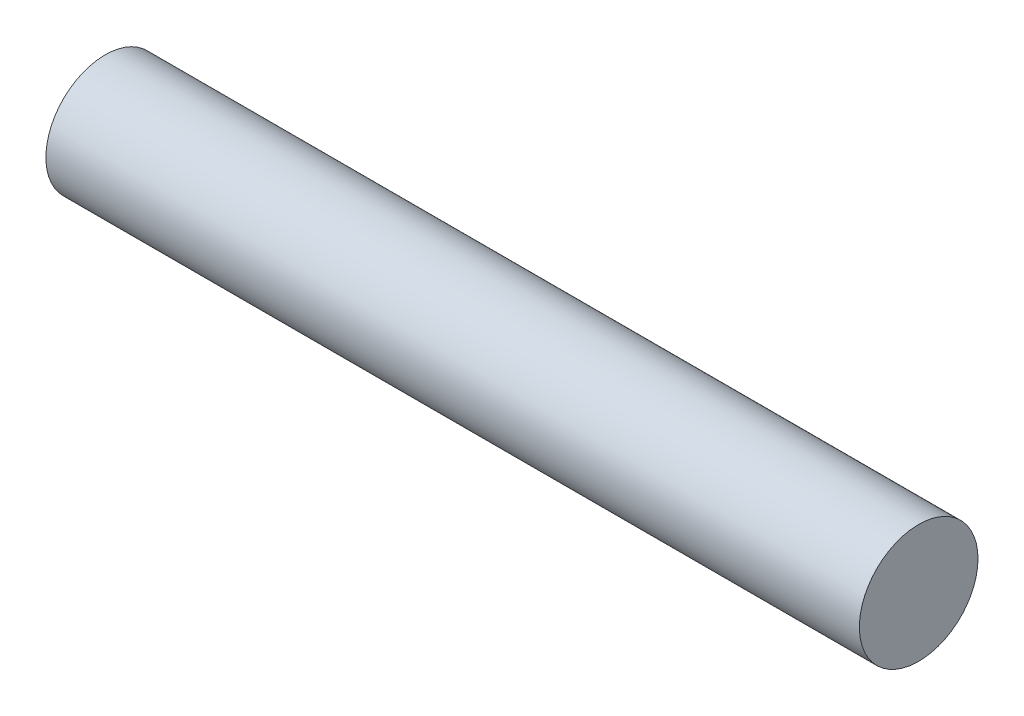
ISO-10303-21;
HEADER;
FILE_DESCRIPTION(('STEP AP214'),'2;1');
FILE_NAME('part.step','',(''),(''),'','','');
FILE_SCHEMA(('AUTOMOTIVE_DESIGN { 1 0 10303 214 1 1 1 1 }'));
ENDSEC;
DATA;
#1=APPLICATION_CONTEXT('core data for automotive mechanical design processes');
#2=APPLICATION_PROTOCOL_DEFINITION('international standard','automotive_design',2000,#1);
#3=PRODUCT_CONTEXT('',#1,'mechanical');
#4=PRODUCT('Part','Part','',(#3));
#5=PRODUCT_RELATED_PRODUCT_CATEGORY('part','',(#4));
#6=PRODUCT_DEFINITION_FORMATION('','',#4);
#7=PRODUCT_DEFINITION_CONTEXT('part definition',#1,'design');
#8=PRODUCT_DEFINITION('design','',#6,#7);
#9=PRODUCT_DEFINITION_SHAPE('','',#8);
#10=(LENGTH_UNIT() NAMED_UNIT(*) SI_UNIT(.MILLI.,.METRE.));
#11=(NAMED_UNIT(*) PLANE_ANGLE_UNIT() SI_UNIT($,.RADIAN.));
#12=(NAMED_UNIT(*) SI_UNIT($,.STERADIAN.) SOLID_ANGLE_UNIT());
#13=UNCERTAINTY_MEASURE_WITH_UNIT(LENGTH_MEASURE(1.E-05),#10,'distance_accuracy_value','');
#14=(GEOMETRIC_REPRESENTATION_CONTEXT(3) GLOBAL_UNCERTAINTY_ASSIGNED_CONTEXT((#13)) GLOBAL_UNIT_ASSIGNED_CONTEXT((#10,
#11,#12)) REPRESENTATION_CONTEXT('',''));
#15=CARTESIAN_POINT('',(0.,0.,0.));
#16=DIRECTION('',(0.,0.,1.));
#17=DIRECTION('',(1.,0.,0.));
#18=AXIS2_PLACEMENT_3D('',#15,#16,#17);
#19=CARTESIAN_POINT('',(76.2,0.,0.));
#20=DIRECTION('',(-1.,0.,0.));
#21=DIRECTION('',(0.,0.,1.));
#22=AXIS2_PLACEMENT_3D('',#19,#20,#21);
#23=CYLINDRICAL_SURFACE('',#22,11.1125);
#24=CARTESIAN_POINT('',(76.2,0.,0.));
#25=DIRECTION('',(1.,0.,0.));
#26=DIRECTION('',(0.,0.,-1.));
#27=AXIS2_PLACEMENT_3D('',#24,#25,#26);
#28=CIRCLE('',#27,11.1125);
#29=CARTESIAN_POINT('',(76.2,0.,-11.1125));
#30=VERTEX_POINT('',#29);
#31=EDGE_CURVE('E10',#30,#30,#28,.T.);
#32=ORIENTED_EDGE('',*,*,#31,.F.);
#33=EDGE_LOOP('',(#32));
#34=FACE_BOUND('',#33,.T.);
#35=CARTESIAN_POINT('',(-76.2,0.,0.));
#36=DIRECTION('',(1.,0.,0.));
#37=DIRECTION('',(0.,0.,-1.));
#38=AXIS2_PLACEMENT_3D('',#35,#36,#37);
#39=CIRCLE('',#38,11.1125);
#40=CARTESIAN_POINT('',(-76.2,0.,-11.1125));
#41=VERTEX_POINT('',#40);
#42=EDGE_CURVE('E33',#41,#41,#39,.T.);
#43=ORIENTED_EDGE('',*,*,#42,.T.);
#44=EDGE_LOOP('',(#43));
#45=FACE_BOUND('',#44,.T.);
#46=ADVANCED_FACE('F30',(#34,#45),#23,.T.);
#47=CARTESIAN_POINT('',(76.2,0.,0.));
#48=DIRECTION('',(1.,0.,0.));
#49=DIRECTION('',(0.,0.,-1.));
#50=AXIS2_PLACEMENT_3D('',#47,#48,#49);
#51=PLANE('',#50);
#52=ORIENTED_EDGE('',*,*,#31,.T.);
#53=EDGE_LOOP('',(#52));
#54=FACE_BOUND('',#53,.T.);
#55=ADVANCED_FACE('F45',(#54),#51,.T.);
#56=CARTESIAN_POINT('',(-76.2,0.,0.));
#57=DIRECTION('',(1.,0.,0.));
#58=DIRECTION('',(0.,0.,-1.));
#59=AXIS2_PLACEMENT_3D('',#56,#57,#58);
#60=PLANE('',#59);
#61=ORIENTED_EDGE('',*,*,#42,.F.);
#62=EDGE_LOOP('',(#61));
#63=FACE_BOUND('',#62,.T.);
#64=ADVANCED_FACE('F43',(#63),#60,.F.);
#65=CLOSED_SHELL('',(#46,#55,#64));
#66=MANIFOLD_SOLID_BREP('B2',#65);
#67=ADVANCED_BREP_SHAPE_REPRESENTATION('',(#18,#66),#14);
#68=SHAPE_DEFINITION_REPRESENTATION(#9,#67);
ENDSEC;
END-ISO-10303-21;
